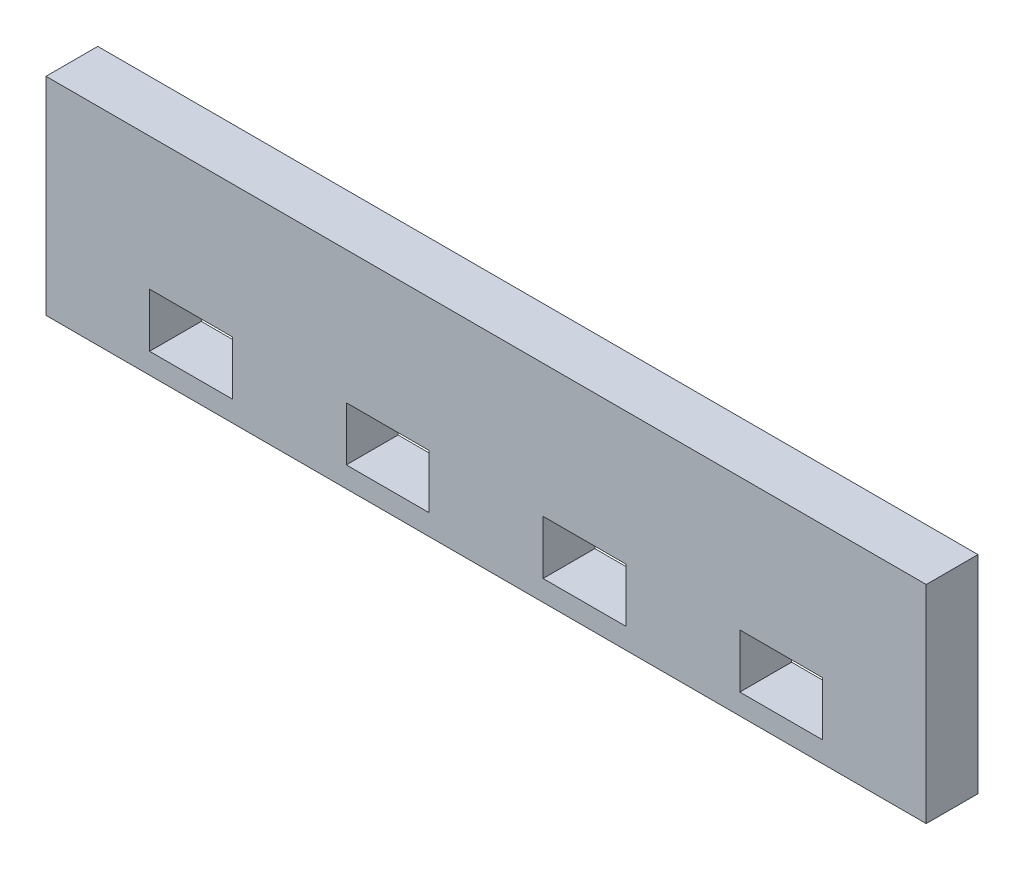
ISO-10303-21;
HEADER;
FILE_DESCRIPTION(('STEP AP214'),'2;1');
FILE_NAME('part.step','',(''),(''),'','','');
FILE_SCHEMA(('AUTOMOTIVE_DESIGN { 1 0 10303 214 1 1 1 1 }'));
ENDSEC;
DATA;
#1=APPLICATION_CONTEXT('core data for automotive mechanical design processes');
#2=APPLICATION_PROTOCOL_DEFINITION('international standard','automotive_design',2000,#1);
#3=PRODUCT_CONTEXT('',#1,'mechanical');
#4=PRODUCT('Part','Part','',(#3));
#5=PRODUCT_RELATED_PRODUCT_CATEGORY('part','',(#4));
#6=PRODUCT_DEFINITION_FORMATION('','',#4);
#7=PRODUCT_DEFINITION_CONTEXT('part definition',#1,'design');
#8=PRODUCT_DEFINITION('design','',#6,#7);
#9=PRODUCT_DEFINITION_SHAPE('','',#8);
#10=(LENGTH_UNIT() NAMED_UNIT(*) SI_UNIT(.MILLI.,.METRE.));
#11=(NAMED_UNIT(*) PLANE_ANGLE_UNIT() SI_UNIT($,.RADIAN.));
#12=(NAMED_UNIT(*) SI_UNIT($,.STERADIAN.) SOLID_ANGLE_UNIT());
#13=UNCERTAINTY_MEASURE_WITH_UNIT(LENGTH_MEASURE(1.E-05),#10,'distance_accuracy_value','');
#14=(GEOMETRIC_REPRESENTATION_CONTEXT(3) GLOBAL_UNCERTAINTY_ASSIGNED_CONTEXT((#13)) GLOBAL_UNIT_ASSIGNED_CONTEXT((#10,
#11,#12)) REPRESENTATION_CONTEXT('',''));
#15=CARTESIAN_POINT('',(0.,0.,0.));
#16=DIRECTION('',(0.,0.,1.));
#17=DIRECTION('',(1.,0.,0.));
#18=AXIS2_PLACEMENT_3D('',#15,#16,#17);
#19=CARTESIAN_POINT('',(-21.9712334180073,20.,5.));
#20=DIRECTION('',(1.,0.,0.));
#21=DIRECTION('',(0.,0.,-1.));
#22=AXIS2_PLACEMENT_3D('',#19,#20,#21);
#23=PLANE('',#22);
#24=DIRECTION('',(0.,-1.,0.));
#25=VECTOR('',#24,1.);
#26=CARTESIAN_POINT('',(-21.9712334180073,20.,0.));
#27=LINE('',#26,#25);
#28=CARTESIAN_POINT('',(-21.9712334180073,20.,0.));
#29=VERTEX_POINT('',#28);
#30=CARTESIAN_POINT('',(-21.9712334180073,0.,0.));
#31=VERTEX_POINT('',#30);
#32=EDGE_CURVE('E300',#29,#31,#27,.T.);
#33=ORIENTED_EDGE('',*,*,#32,.T.);
#34=DIRECTION('',(0.,0.,-1.));
#35=VECTOR('',#34,1.);
#36=CARTESIAN_POINT('',(-21.9712334180073,0.,5.));
#37=LINE('',#36,#35);
#38=CARTESIAN_POINT('',(-21.9712334180073,0.,5.));
#39=VERTEX_POINT('',#38);
#40=EDGE_CURVE('E11',#39,#31,#37,.T.);
#41=ORIENTED_EDGE('',*,*,#40,.F.);
#42=DIRECTION('',(0.,-1.,0.));
#43=VECTOR('',#42,1.);
#44=CARTESIAN_POINT('',(-21.9712334180073,20.,5.));
#45=LINE('',#44,#43);
#46=CARTESIAN_POINT('',(-21.9712334180073,20.,5.));
#47=VERTEX_POINT('',#46);
#48=EDGE_CURVE('E301',#47,#39,#45,.T.);
#49=ORIENTED_EDGE('',*,*,#48,.F.);
#50=DIRECTION('',(0.,0.,-1.));
#51=VECTOR('',#50,1.);
#52=CARTESIAN_POINT('',(-21.9712334180073,20.,5.));
#53=LINE('',#52,#51);
#54=EDGE_CURVE('E313',#47,#29,#53,.T.);
#55=ORIENTED_EDGE('',*,*,#54,.T.);
#56=EDGE_LOOP('',(#33,#41,#49,#55));
#57=FACE_BOUND('',#56,.T.);
#58=ADVANCED_FACE('F35',(#57),#23,.F.);
#59=CARTESIAN_POINT('',(-21.9712334180073,0.,5.));
#60=DIRECTION('',(0.,1.,0.));
#61=DIRECTION('',(0.,0.,1.));
#62=AXIS2_PLACEMENT_3D('',#59,#60,#61);
#63=PLANE('',#62);
#64=DIRECTION('',(1.,0.,0.));
#65=VECTOR('',#64,1.);
#66=CARTESIAN_POINT('',(-21.9712334180073,0.,0.));
#67=LINE('',#66,#65);
#68=CARTESIAN_POINT('',(63.0287665819927,0.,0.));
#69=VERTEX_POINT('',#68);
#70=EDGE_CURVE('E316',#31,#69,#67,.T.);
#71=ORIENTED_EDGE('',*,*,#70,.T.);
#72=DIRECTION('',(0.,0.,-1.));
#73=VECTOR('',#72,1.);
#74=CARTESIAN_POINT('',(63.0287665819927,0.,5.));
#75=LINE('',#74,#73);
#76=CARTESIAN_POINT('',(63.0287665819927,0.,5.));
#77=VERTEX_POINT('',#76);
#78=EDGE_CURVE('E42',#77,#69,#75,.T.);
#79=ORIENTED_EDGE('',*,*,#78,.F.);
#80=DIRECTION('',(1.,0.,0.));
#81=VECTOR('',#80,1.);
#82=CARTESIAN_POINT('',(-21.9712334180073,0.,5.));
#83=LINE('',#82,#81);
#84=EDGE_CURVE('E304',#39,#77,#83,.T.);
#85=ORIENTED_EDGE('',*,*,#84,.F.);
#86=ORIENTED_EDGE('',*,*,#40,.T.);
#87=EDGE_LOOP('',(#71,#79,#85,#86));
#88=FACE_BOUND('',#87,.T.);
#89=ADVANCED_FACE('F332',(#88),#63,.F.);
#90=CARTESIAN_POINT('',(63.0287665819927,20.,5.));
#91=DIRECTION('',(1.,0.,0.));
#92=DIRECTION('',(0.,0.,-1.));
#93=AXIS2_PLACEMENT_3D('',#90,#91,#92);
#94=PLANE('',#93);
#95=DIRECTION('',(0.,-1.,0.));
#96=VECTOR('',#95,1.);
#97=CARTESIAN_POINT('',(63.0287665819927,20.,0.));
#98=LINE('',#97,#96);
#99=CARTESIAN_POINT('',(63.0287665819927,20.,0.));
#100=VERTEX_POINT('',#99);
#101=EDGE_CURVE('E319',#100,#69,#98,.T.);
#102=ORIENTED_EDGE('',*,*,#101,.F.);
#103=DIRECTION('',(0.,0.,-1.));
#104=VECTOR('',#103,1.);
#105=CARTESIAN_POINT('',(63.0287665819927,20.,5.));
#106=LINE('',#105,#104);
#107=CARTESIAN_POINT('',(63.0287665819927,20.,5.));
#108=VERTEX_POINT('',#107);
#109=EDGE_CURVE('E325',#108,#100,#106,.T.);
#110=ORIENTED_EDGE('',*,*,#109,.F.);
#111=DIRECTION('',(0.,-1.,0.));
#112=VECTOR('',#111,1.);
#113=CARTESIAN_POINT('',(63.0287665819927,20.,5.));
#114=LINE('',#113,#112);
#115=EDGE_CURVE('E307',#108,#77,#114,.T.);
#116=ORIENTED_EDGE('',*,*,#115,.T.);
#117=ORIENTED_EDGE('',*,*,#78,.T.);
#118=EDGE_LOOP('',(#102,#110,#116,#117));
#119=FACE_BOUND('',#118,.T.);
#120=ADVANCED_FACE('F329',(#119),#94,.T.);
#121=CARTESIAN_POINT('',(-21.9712334180073,20.,5.));
#122=DIRECTION('',(0.,1.,0.));
#123=DIRECTION('',(0.,0.,1.));
#124=AXIS2_PLACEMENT_3D('',#121,#122,#123);
#125=PLANE('',#124);
#126=DIRECTION('',(1.,0.,0.));
#127=VECTOR('',#126,1.);
#128=CARTESIAN_POINT('',(-21.9712334180073,20.,0.));
#129=LINE('',#128,#127);
#130=EDGE_CURVE('E305',#29,#100,#129,.T.);
#131=ORIENTED_EDGE('',*,*,#130,.F.);
#132=ORIENTED_EDGE('',*,*,#54,.F.);
#133=DIRECTION('',(1.,0.,0.));
#134=VECTOR('',#133,1.);
#135=CARTESIAN_POINT('',(-21.9712334180073,20.,5.));
#136=LINE('',#135,#134);
#137=EDGE_CURVE('E310',#47,#108,#136,.T.);
#138=ORIENTED_EDGE('',*,*,#137,.T.);
#139=ORIENTED_EDGE('',*,*,#109,.T.);
#140=EDGE_LOOP('',(#131,#132,#138,#139));
#141=FACE_BOUND('',#140,.T.);
#142=ADVANCED_FACE('F338',(#141),#125,.T.);
#143=CARTESIAN_POINT('',(0.,0.,5.));
#144=DIRECTION('',(0.,0.,1.));
#145=DIRECTION('',(1.,0.,0.));
#146=AXIS2_PLACEMENT_3D('',#143,#144,#145);
#147=PLANE('',#146);
#148=DIRECTION('',(0.,-1.,0.));
#149=VECTOR('',#148,1.);
#150=CARTESIAN_POINT('',(45.0287665819927,7.2,5.));
#151=LINE('',#150,#149);
#152=CARTESIAN_POINT('',(45.0287665819927,7.2,5.));
#153=VERTEX_POINT('',#152);
#154=CARTESIAN_POINT('',(45.0287665819927,2.,5.));
#155=VERTEX_POINT('',#154);
#156=EDGE_CURVE('E49',#153,#155,#151,.T.);
#157=ORIENTED_EDGE('',*,*,#156,.F.);
#158=DIRECTION('',(-1.,0.,0.));
#159=VECTOR('',#158,1.);
#160=CARTESIAN_POINT('',(45.0287665819927,7.2,5.));
#161=LINE('',#160,#159);
#162=CARTESIAN_POINT('',(53.0287665819927,7.2,5.));
#163=VERTEX_POINT('',#162);
#164=EDGE_CURVE('E179',#163,#153,#161,.T.);
#165=ORIENTED_EDGE('',*,*,#164,.F.);
#166=DIRECTION('',(0.,1.,0.));
#167=VECTOR('',#166,1.);
#168=CARTESIAN_POINT('',(53.0287665819927,7.2,5.));
#169=LINE('',#168,#167);
#170=CARTESIAN_POINT('',(53.0287665819927,2.,5.));
#171=VERTEX_POINT('',#170);
#172=EDGE_CURVE('E199',#171,#163,#169,.T.);
#173=ORIENTED_EDGE('',*,*,#172,.F.);
#174=DIRECTION('',(1.,0.,0.));
#175=VECTOR('',#174,1.);
#176=CARTESIAN_POINT('',(45.0287665819927,2.,5.));
#177=LINE('',#176,#175);
#178=EDGE_CURVE('E193',#155,#171,#177,.T.);
#179=ORIENTED_EDGE('',*,*,#178,.F.);
#180=EDGE_LOOP('',(#157,#165,#173,#179));
#181=FACE_BOUND('',#180,.T.);
#182=DIRECTION('',(0.,-1.,0.));
#183=VECTOR('',#182,1.);
#184=CARTESIAN_POINT('',(26.0287665819927,7.2,5.));
#185=LINE('',#184,#183);
#186=CARTESIAN_POINT('',(26.0287665819927,7.2,5.));
#187=VERTEX_POINT('',#186);
#188=CARTESIAN_POINT('',(26.0287665819927,2.,5.));
#189=VERTEX_POINT('',#188);
#190=EDGE_CURVE('E215',#187,#189,#185,.T.);
#191=ORIENTED_EDGE('',*,*,#190,.F.);
#192=DIRECTION('',(-1.,0.,0.));
#193=VECTOR('',#192,1.);
#194=CARTESIAN_POINT('',(26.0287665819927,7.2,5.));
#195=LINE('',#194,#193);
#196=CARTESIAN_POINT('',(34.0287665819927,7.2,5.));
#197=VERTEX_POINT('',#196);
#198=EDGE_CURVE('E223',#197,#187,#195,.T.);
#199=ORIENTED_EDGE('',*,*,#198,.F.);
#200=DIRECTION('',(0.,1.,0.));
#201=VECTOR('',#200,1.);
#202=CARTESIAN_POINT('',(34.0287665819927,7.2,5.));
#203=LINE('',#202,#201);
#204=CARTESIAN_POINT('',(34.0287665819927,2.,5.));
#205=VERTEX_POINT('',#204);
#206=EDGE_CURVE('E220',#205,#197,#203,.T.);
#207=ORIENTED_EDGE('',*,*,#206,.F.);
#208=DIRECTION('',(1.,0.,0.));
#209=VECTOR('',#208,1.);
#210=CARTESIAN_POINT('',(26.0287665819927,2.,5.));
#211=LINE('',#210,#209);
#212=EDGE_CURVE('E217',#189,#205,#211,.T.);
#213=ORIENTED_EDGE('',*,*,#212,.F.);
#214=EDGE_LOOP('',(#191,#199,#207,#213));
#215=FACE_BOUND('',#214,.T.);
#216=DIRECTION('',(0.,-1.,0.));
#217=VECTOR('',#216,1.);
#218=CARTESIAN_POINT('',(7.02876658199267,7.2,5.));
#219=LINE('',#218,#217);
#220=CARTESIAN_POINT('',(7.02876658199267,7.2,5.));
#221=VERTEX_POINT('',#220);
#222=CARTESIAN_POINT('',(7.02876658199267,2.,5.));
#223=VERTEX_POINT('',#222);
#224=EDGE_CURVE('E246',#221,#223,#219,.T.);
#225=ORIENTED_EDGE('',*,*,#224,.F.);
#226=DIRECTION('',(-1.,0.,0.));
#227=VECTOR('',#226,1.);
#228=CARTESIAN_POINT('',(7.02876658199267,7.2,5.));
#229=LINE('',#228,#227);
#230=CARTESIAN_POINT('',(15.0287665819927,7.2,5.));
#231=VERTEX_POINT('',#230);
#232=EDGE_CURVE('E254',#231,#221,#229,.T.);
#233=ORIENTED_EDGE('',*,*,#232,.F.);
#234=DIRECTION('',(0.,1.,0.));
#235=VECTOR('',#234,1.);
#236=CARTESIAN_POINT('',(15.0287665819927,7.2,5.));
#237=LINE('',#236,#235);
#238=CARTESIAN_POINT('',(15.0287665819927,2.,5.));
#239=VERTEX_POINT('',#238);
#240=EDGE_CURVE('E251',#239,#231,#237,.T.);
#241=ORIENTED_EDGE('',*,*,#240,.F.);
#242=DIRECTION('',(1.,0.,0.));
#243=VECTOR('',#242,1.);
#244=CARTESIAN_POINT('',(7.02876658199267,2.,5.));
#245=LINE('',#244,#243);
#246=EDGE_CURVE('E248',#223,#239,#245,.T.);
#247=ORIENTED_EDGE('',*,*,#246,.F.);
#248=EDGE_LOOP('',(#225,#233,#241,#247));
#249=FACE_BOUND('',#248,.T.);
#250=DIRECTION('',(0.,-1.,0.));
#251=VECTOR('',#250,1.);
#252=CARTESIAN_POINT('',(-11.9712334180073,7.2,5.));
#253=LINE('',#252,#251);
#254=CARTESIAN_POINT('',(-11.9712334180073,7.2,5.));
#255=VERTEX_POINT('',#254);
#256=CARTESIAN_POINT('',(-11.9712334180073,2.,5.));
#257=VERTEX_POINT('',#256);
#258=EDGE_CURVE('E277',#255,#257,#253,.T.);
#259=ORIENTED_EDGE('',*,*,#258,.F.);
#260=DIRECTION('',(-1.,0.,0.));
#261=VECTOR('',#260,1.);
#262=CARTESIAN_POINT('',(-11.9712334180073,7.2,5.));
#263=LINE('',#262,#261);
#264=CARTESIAN_POINT('',(-3.97123341800733,7.2,5.));
#265=VERTEX_POINT('',#264);
#266=EDGE_CURVE('E285',#265,#255,#263,.T.);
#267=ORIENTED_EDGE('',*,*,#266,.F.);
#268=DIRECTION('',(0.,1.,0.));
#269=VECTOR('',#268,1.);
#270=CARTESIAN_POINT('',(-3.97123341800733,7.2,5.));
#271=LINE('',#270,#269);
#272=CARTESIAN_POINT('',(-3.97123341800733,2.,5.));
#273=VERTEX_POINT('',#272);
#274=EDGE_CURVE('E282',#273,#265,#271,.T.);
#275=ORIENTED_EDGE('',*,*,#274,.F.);
#276=DIRECTION('',(1.,0.,0.));
#277=VECTOR('',#276,1.);
#278=CARTESIAN_POINT('',(-11.9712334180073,2.,5.));
#279=LINE('',#278,#277);
#280=EDGE_CURVE('E279',#257,#273,#279,.T.);
#281=ORIENTED_EDGE('',*,*,#280,.F.);
#282=EDGE_LOOP('',(#259,#267,#275,#281));
#283=FACE_BOUND('',#282,.T.);
#284=ORIENTED_EDGE('',*,*,#48,.T.);
#285=ORIENTED_EDGE('',*,*,#84,.T.);
#286=ORIENTED_EDGE('',*,*,#115,.F.);
#287=ORIENTED_EDGE('',*,*,#137,.F.);
#288=EDGE_LOOP('',(#284,#285,#286,#287));
#289=FACE_BOUND('',#288,.T.);
#290=ADVANCED_FACE('F342',(#181,#215,#249,#283,#289),#147,.T.);
#291=CARTESIAN_POINT('',(0.,0.,0.));
#292=DIRECTION('',(0.,0.,1.));
#293=DIRECTION('',(1.,0.,0.));
#294=AXIS2_PLACEMENT_3D('',#291,#292,#293);
#295=PLANE('',#294);
#296=DIRECTION('',(1.,0.,0.));
#297=VECTOR('',#296,1.);
#298=CARTESIAN_POINT('',(45.0287665819927,7.2,0.));
#299=LINE('',#298,#297);
#300=CARTESIAN_POINT('',(45.0287665819927,7.2,0.));
#301=VERTEX_POINT('',#300);
#302=CARTESIAN_POINT('',(53.0287665819927,7.2,0.));
#303=VERTEX_POINT('',#302);
#304=EDGE_CURVE('E191',#301,#303,#299,.T.);
#305=ORIENTED_EDGE('',*,*,#304,.F.);
#306=DIRECTION('',(0.,1.,0.));
#307=VECTOR('',#306,1.);
#308=CARTESIAN_POINT('',(45.0287665819927,7.2,0.));
#309=LINE('',#308,#307);
#310=CARTESIAN_POINT('',(45.0287665819927,2.,0.));
#311=VERTEX_POINT('',#310);
#312=EDGE_CURVE('E173',#311,#301,#309,.T.);
#313=ORIENTED_EDGE('',*,*,#312,.F.);
#314=DIRECTION('',(-1.,0.,0.));
#315=VECTOR('',#314,1.);
#316=CARTESIAN_POINT('',(45.0287665819927,2.,0.));
#317=LINE('',#316,#315);
#318=CARTESIAN_POINT('',(53.0287665819927,2.,0.));
#319=VERTEX_POINT('',#318);
#320=EDGE_CURVE('E182',#319,#311,#317,.T.);
#321=ORIENTED_EDGE('',*,*,#320,.F.);
#322=DIRECTION('',(0.,-1.,0.));
#323=VECTOR('',#322,1.);
#324=CARTESIAN_POINT('',(53.0287665819927,7.2,0.));
#325=LINE('',#324,#323);
#326=EDGE_CURVE('E57',#303,#319,#325,.T.);
#327=ORIENTED_EDGE('',*,*,#326,.F.);
#328=EDGE_LOOP('',(#305,#313,#321,#327));
#329=FACE_BOUND('',#328,.T.);
#330=DIRECTION('',(1.,0.,0.));
#331=VECTOR('',#330,1.);
#332=CARTESIAN_POINT('',(26.0287665819927,7.2,0.));
#333=LINE('',#332,#331);
#334=CARTESIAN_POINT('',(26.0287665819927,7.2,0.));
#335=VERTEX_POINT('',#334);
#336=CARTESIAN_POINT('',(34.0287665819927,7.2,0.));
#337=VERTEX_POINT('',#336);
#338=EDGE_CURVE('E209',#335,#337,#333,.T.);
#339=ORIENTED_EDGE('',*,*,#338,.F.);
#340=DIRECTION('',(0.,1.,0.));
#341=VECTOR('',#340,1.);
#342=CARTESIAN_POINT('',(26.0287665819927,7.2,0.));
#343=LINE('',#342,#341);
#344=CARTESIAN_POINT('',(26.0287665819927,2.,0.));
#345=VERTEX_POINT('',#344);
#346=EDGE_CURVE('E212',#345,#335,#343,.T.);
#347=ORIENTED_EDGE('',*,*,#346,.F.);
#348=DIRECTION('',(-1.,0.,0.));
#349=VECTOR('',#348,1.);
#350=CARTESIAN_POINT('',(26.0287665819927,2.,0.));
#351=LINE('',#350,#349);
#352=CARTESIAN_POINT('',(34.0287665819927,2.,0.));
#353=VERTEX_POINT('',#352);
#354=EDGE_CURVE('E229',#353,#345,#351,.T.);
#355=ORIENTED_EDGE('',*,*,#354,.F.);
#356=DIRECTION('',(0.,-1.,0.));
#357=VECTOR('',#356,1.);
#358=CARTESIAN_POINT('',(34.0287665819927,7.2,0.));
#359=LINE('',#358,#357);
#360=EDGE_CURVE('E185',#337,#353,#359,.T.);
#361=ORIENTED_EDGE('',*,*,#360,.F.);
#362=EDGE_LOOP('',(#339,#347,#355,#361));
#363=FACE_BOUND('',#362,.T.);
#364=DIRECTION('',(1.,0.,0.));
#365=VECTOR('',#364,1.);
#366=CARTESIAN_POINT('',(7.02876658199267,7.2,0.));
#367=LINE('',#366,#365);
#368=CARTESIAN_POINT('',(7.02876658199267,7.2,0.));
#369=VERTEX_POINT('',#368);
#370=CARTESIAN_POINT('',(15.0287665819927,7.2,0.));
#371=VERTEX_POINT('',#370);
#372=EDGE_CURVE('E240',#369,#371,#367,.T.);
#373=ORIENTED_EDGE('',*,*,#372,.F.);
#374=DIRECTION('',(0.,1.,0.));
#375=VECTOR('',#374,1.);
#376=CARTESIAN_POINT('',(7.02876658199267,7.2,0.));
#377=LINE('',#376,#375);
#378=CARTESIAN_POINT('',(7.02876658199267,2.,0.));
#379=VERTEX_POINT('',#378);
#380=EDGE_CURVE('E243',#379,#369,#377,.T.);
#381=ORIENTED_EDGE('',*,*,#380,.F.);
#382=DIRECTION('',(-1.,0.,0.));
#383=VECTOR('',#382,1.);
#384=CARTESIAN_POINT('',(7.02876658199267,2.,0.));
#385=LINE('',#384,#383);
#386=CARTESIAN_POINT('',(15.0287665819927,2.,0.));
#387=VERTEX_POINT('',#386);
#388=EDGE_CURVE('E260',#387,#379,#385,.T.);
#389=ORIENTED_EDGE('',*,*,#388,.F.);
#390=DIRECTION('',(0.,-1.,0.));
#391=VECTOR('',#390,1.);
#392=CARTESIAN_POINT('',(15.0287665819927,7.2,0.));
#393=LINE('',#392,#391);
#394=EDGE_CURVE('E238',#371,#387,#393,.T.);
#395=ORIENTED_EDGE('',*,*,#394,.F.);
#396=EDGE_LOOP('',(#373,#381,#389,#395));
#397=FACE_BOUND('',#396,.T.);
#398=DIRECTION('',(1.,0.,0.));
#399=VECTOR('',#398,1.);
#400=CARTESIAN_POINT('',(-11.9712334180073,7.2,0.));
#401=LINE('',#400,#399);
#402=CARTESIAN_POINT('',(-11.9712334180073,7.2,0.));
#403=VERTEX_POINT('',#402);
#404=CARTESIAN_POINT('',(-3.97123341800733,7.2,0.));
#405=VERTEX_POINT('',#404);
#406=EDGE_CURVE('E271',#403,#405,#401,.T.);
#407=ORIENTED_EDGE('',*,*,#406,.F.);
#408=DIRECTION('',(0.,1.,0.));
#409=VECTOR('',#408,1.);
#410=CARTESIAN_POINT('',(-11.9712334180073,7.2,0.));
#411=LINE('',#410,#409);
#412=CARTESIAN_POINT('',(-11.9712334180073,2.,0.));
#413=VERTEX_POINT('',#412);
#414=EDGE_CURVE('E274',#413,#403,#411,.T.);
#415=ORIENTED_EDGE('',*,*,#414,.F.);
#416=DIRECTION('',(-1.,0.,0.));
#417=VECTOR('',#416,1.);
#418=CARTESIAN_POINT('',(-11.9712334180073,2.,0.));
#419=LINE('',#418,#417);
#420=CARTESIAN_POINT('',(-3.97123341800733,2.,0.));
#421=VERTEX_POINT('',#420);
#422=EDGE_CURVE('E291',#421,#413,#419,.T.);
#423=ORIENTED_EDGE('',*,*,#422,.F.);
#424=DIRECTION('',(0.,-1.,0.));
#425=VECTOR('',#424,1.);
#426=CARTESIAN_POINT('',(-3.97123341800733,7.2,0.));
#427=LINE('',#426,#425);
#428=EDGE_CURVE('E269',#405,#421,#427,.T.);
#429=ORIENTED_EDGE('',*,*,#428,.F.);
#430=EDGE_LOOP('',(#407,#415,#423,#429));
#431=FACE_BOUND('',#430,.T.);
#432=ORIENTED_EDGE('',*,*,#32,.F.);
#433=ORIENTED_EDGE('',*,*,#130,.T.);
#434=ORIENTED_EDGE('',*,*,#101,.T.);
#435=ORIENTED_EDGE('',*,*,#70,.F.);
#436=EDGE_LOOP('',(#432,#433,#434,#435));
#437=FACE_BOUND('',#436,.T.);
#438=ADVANCED_FACE('F188',(#329,#363,#397,#431,#437),#295,.F.);
#439=CARTESIAN_POINT('',(-11.9712334180073,7.2,-0.00100000000000013));
#440=DIRECTION('',(-1.,0.,0.));
#441=DIRECTION('',(0.,0.,1.));
#442=AXIS2_PLACEMENT_3D('',#439,#440,#441);
#443=PLANE('',#442);
#444=ORIENTED_EDGE('',*,*,#414,.T.);
#445=DIRECTION('',(0.,0.,1.));
#446=VECTOR('',#445,1.);
#447=CARTESIAN_POINT('',(-11.9712334180073,7.2,-0.00100000000000013));
#448=LINE('',#447,#446);
#449=EDGE_CURVE('E289',#403,#255,#448,.T.);
#450=ORIENTED_EDGE('',*,*,#449,.T.);
#451=ORIENTED_EDGE('',*,*,#258,.T.);
#452=DIRECTION('',(0.,0.,1.));
#453=VECTOR('',#452,1.);
#454=CARTESIAN_POINT('',(-11.9712334180073,2.,-0.00100000000000013));
#455=LINE('',#454,#453);
#456=EDGE_CURVE('E288',#413,#257,#455,.T.);
#457=ORIENTED_EDGE('',*,*,#456,.F.);
#458=EDGE_LOOP('',(#444,#450,#451,#457));
#459=FACE_BOUND('',#458,.T.);
#460=ADVANCED_FACE('F357',(#459),#443,.F.);
#461=CARTESIAN_POINT('',(-11.9712334180073,7.2,-0.00100000000000013));
#462=DIRECTION('',(0.,1.,0.));
#463=DIRECTION('',(0.,0.,1.));
#464=AXIS2_PLACEMENT_3D('',#461,#462,#463);
#465=PLANE('',#464);
#466=ORIENTED_EDGE('',*,*,#406,.T.);
#467=DIRECTION('',(0.,0.,1.));
#468=VECTOR('',#467,1.);
#469=CARTESIAN_POINT('',(-3.97123341800733,7.2,-0.00100000000000013));
#470=LINE('',#469,#468);
#471=EDGE_CURVE('E292',#405,#265,#470,.T.);
#472=ORIENTED_EDGE('',*,*,#471,.T.);
#473=ORIENTED_EDGE('',*,*,#266,.T.);
#474=ORIENTED_EDGE('',*,*,#449,.F.);
#475=EDGE_LOOP('',(#466,#472,#473,#474));
#476=FACE_BOUND('',#475,.T.);
#477=ADVANCED_FACE('F363',(#476),#465,.F.);
#478=CARTESIAN_POINT('',(-3.97123341800733,7.2,-0.00100000000000013));
#479=DIRECTION('',(1.,0.,0.));
#480=DIRECTION('',(0.,1.,0.));
#481=AXIS2_PLACEMENT_3D('',#478,#479,#480);
#482=PLANE('',#481);
#483=ORIENTED_EDGE('',*,*,#428,.T.);
#484=DIRECTION('',(0.,0.,1.));
#485=VECTOR('',#484,1.);
#486=CARTESIAN_POINT('',(-3.97123341800733,2.,-0.00100000000000013));
#487=LINE('',#486,#485);
#488=EDGE_CURVE('E294',#421,#273,#487,.T.);
#489=ORIENTED_EDGE('',*,*,#488,.T.);
#490=ORIENTED_EDGE('',*,*,#274,.T.);
#491=ORIENTED_EDGE('',*,*,#471,.F.);
#492=EDGE_LOOP('',(#483,#489,#490,#491));
#493=FACE_BOUND('',#492,.T.);
#494=ADVANCED_FACE('F369',(#493),#482,.F.);
#495=CARTESIAN_POINT('',(-11.9712334180073,2.,-0.00100000000000013));
#496=DIRECTION('',(0.,-1.,0.));
#497=DIRECTION('',(1.,0.,0.));
#498=AXIS2_PLACEMENT_3D('',#495,#496,#497);
#499=PLANE('',#498);
#500=ORIENTED_EDGE('',*,*,#422,.T.);
#501=ORIENTED_EDGE('',*,*,#456,.T.);
#502=ORIENTED_EDGE('',*,*,#280,.T.);
#503=ORIENTED_EDGE('',*,*,#488,.F.);
#504=EDGE_LOOP('',(#500,#501,#502,#503));
#505=FACE_BOUND('',#504,.T.);
#506=ADVANCED_FACE('F365',(#505),#499,.F.);
#507=CARTESIAN_POINT('',(7.02876658199267,7.2,-0.00100000000000013));
#508=DIRECTION('',(-1.,0.,0.));
#509=DIRECTION('',(0.,0.,1.));
#510=AXIS2_PLACEMENT_3D('',#507,#508,#509);
#511=PLANE('',#510);
#512=ORIENTED_EDGE('',*,*,#380,.T.);
#513=DIRECTION('',(0.,0.,1.));
#514=VECTOR('',#513,1.);
#515=CARTESIAN_POINT('',(7.02876658199267,7.2,-0.00100000000000013));
#516=LINE('',#515,#514);
#517=EDGE_CURVE('E258',#369,#221,#516,.T.);
#518=ORIENTED_EDGE('',*,*,#517,.T.);
#519=ORIENTED_EDGE('',*,*,#224,.T.);
#520=DIRECTION('',(0.,0.,1.));
#521=VECTOR('',#520,1.);
#522=CARTESIAN_POINT('',(7.02876658199267,2.,-0.00100000000000013));
#523=LINE('',#522,#521);
#524=EDGE_CURVE('E257',#379,#223,#523,.T.);
#525=ORIENTED_EDGE('',*,*,#524,.F.);
#526=EDGE_LOOP('',(#512,#518,#519,#525));
#527=FACE_BOUND('',#526,.T.);
#528=ADVANCED_FACE('F368',(#527),#511,.F.);
#529=CARTESIAN_POINT('',(7.02876658199267,7.2,-0.00100000000000013));
#530=DIRECTION('',(0.,1.,0.));
#531=DIRECTION('',(0.,0.,1.));
#532=AXIS2_PLACEMENT_3D('',#529,#530,#531);
#533=PLANE('',#532);
#534=ORIENTED_EDGE('',*,*,#372,.T.);
#535=DIRECTION('',(0.,0.,1.));
#536=VECTOR('',#535,1.);
#537=CARTESIAN_POINT('',(15.0287665819927,7.2,-0.00100000000000013));
#538=LINE('',#537,#536);
#539=EDGE_CURVE('E261',#371,#231,#538,.T.);
#540=ORIENTED_EDGE('',*,*,#539,.T.);
#541=ORIENTED_EDGE('',*,*,#232,.T.);
#542=ORIENTED_EDGE('',*,*,#517,.F.);
#543=EDGE_LOOP('',(#534,#540,#541,#542));
#544=FACE_BOUND('',#543,.T.);
#545=ADVANCED_FACE('F379',(#544),#533,.F.);
#546=CARTESIAN_POINT('',(15.0287665819927,7.2,-0.00100000000000013));
#547=DIRECTION('',(1.,0.,0.));
#548=DIRECTION('',(0.,0.,-1.));
#549=AXIS2_PLACEMENT_3D('',#546,#547,#548);
#550=PLANE('',#549);
#551=ORIENTED_EDGE('',*,*,#394,.T.);
#552=DIRECTION('',(0.,0.,1.));
#553=VECTOR('',#552,1.);
#554=CARTESIAN_POINT('',(15.0287665819927,2.,-0.00100000000000013));
#555=LINE('',#554,#553);
#556=EDGE_CURVE('E263',#387,#239,#555,.T.);
#557=ORIENTED_EDGE('',*,*,#556,.T.);
#558=ORIENTED_EDGE('',*,*,#240,.T.);
#559=ORIENTED_EDGE('',*,*,#539,.F.);
#560=EDGE_LOOP('',(#551,#557,#558,#559));
#561=FACE_BOUND('',#560,.T.);
#562=ADVANCED_FACE('F385',(#561),#550,.F.);
#563=CARTESIAN_POINT('',(7.02876658199267,2.,-0.00100000000000013));
#564=DIRECTION('',(0.,-1.,0.));
#565=DIRECTION('',(1.,0.,0.));
#566=AXIS2_PLACEMENT_3D('',#563,#564,#565);
#567=PLANE('',#566);
#568=ORIENTED_EDGE('',*,*,#388,.T.);
#569=ORIENTED_EDGE('',*,*,#524,.T.);
#570=ORIENTED_EDGE('',*,*,#246,.T.);
#571=ORIENTED_EDGE('',*,*,#556,.F.);
#572=EDGE_LOOP('',(#568,#569,#570,#571));
#573=FACE_BOUND('',#572,.T.);
#574=ADVANCED_FACE('F381',(#573),#567,.F.);
#575=CARTESIAN_POINT('',(26.0287665819927,7.2,-0.00100000000000013));
#576=DIRECTION('',(-1.,0.,0.));
#577=DIRECTION('',(0.,0.,1.));
#578=AXIS2_PLACEMENT_3D('',#575,#576,#577);
#579=PLANE('',#578);
#580=ORIENTED_EDGE('',*,*,#346,.T.);
#581=DIRECTION('',(0.,0.,1.));
#582=VECTOR('',#581,1.);
#583=CARTESIAN_POINT('',(26.0287665819927,7.2,-0.00100000000000013));
#584=LINE('',#583,#582);
#585=EDGE_CURVE('E227',#335,#187,#584,.T.);
#586=ORIENTED_EDGE('',*,*,#585,.T.);
#587=ORIENTED_EDGE('',*,*,#190,.T.);
#588=DIRECTION('',(0.,0.,1.));
#589=VECTOR('',#588,1.);
#590=CARTESIAN_POINT('',(26.0287665819927,2.,-0.00100000000000013));
#591=LINE('',#590,#589);
#592=EDGE_CURVE('E226',#345,#189,#591,.T.);
#593=ORIENTED_EDGE('',*,*,#592,.F.);
#594=EDGE_LOOP('',(#580,#586,#587,#593));
#595=FACE_BOUND('',#594,.T.);
#596=ADVANCED_FACE('F384',(#595),#579,.F.);
#597=CARTESIAN_POINT('',(26.0287665819927,7.2,-0.00100000000000013));
#598=DIRECTION('',(0.,1.,0.));
#599=DIRECTION('',(0.,0.,1.));
#600=AXIS2_PLACEMENT_3D('',#597,#598,#599);
#601=PLANE('',#600);
#602=ORIENTED_EDGE('',*,*,#338,.T.);
#603=DIRECTION('',(0.,0.,1.));
#604=VECTOR('',#603,1.);
#605=CARTESIAN_POINT('',(34.0287665819927,7.2,-0.00100000000000013));
#606=LINE('',#605,#604);
#607=EDGE_CURVE('E230',#337,#197,#606,.T.);
#608=ORIENTED_EDGE('',*,*,#607,.T.);
#609=ORIENTED_EDGE('',*,*,#198,.T.);
#610=ORIENTED_EDGE('',*,*,#585,.F.);
#611=EDGE_LOOP('',(#602,#608,#609,#610));
#612=FACE_BOUND('',#611,.T.);
#613=ADVANCED_FACE('F395',(#612),#601,.F.);
#614=CARTESIAN_POINT('',(34.0287665819927,7.2,-0.00100000000000013));
#615=DIRECTION('',(1.,0.,0.));
#616=DIRECTION('',(0.,0.,-1.));
#617=AXIS2_PLACEMENT_3D('',#614,#615,#616);
#618=PLANE('',#617);
#619=ORIENTED_EDGE('',*,*,#360,.T.);
#620=DIRECTION('',(0.,0.,1.));
#621=VECTOR('',#620,1.);
#622=CARTESIAN_POINT('',(34.0287665819927,2.,-0.00100000000000013));
#623=LINE('',#622,#621);
#624=EDGE_CURVE('E232',#353,#205,#623,.T.);
#625=ORIENTED_EDGE('',*,*,#624,.T.);
#626=ORIENTED_EDGE('',*,*,#206,.T.);
#627=ORIENTED_EDGE('',*,*,#607,.F.);
#628=EDGE_LOOP('',(#619,#625,#626,#627));
#629=FACE_BOUND('',#628,.T.);
#630=ADVANCED_FACE('F400',(#629),#618,.F.);
#631=CARTESIAN_POINT('',(26.0287665819927,2.,-0.00100000000000013));
#632=DIRECTION('',(0.,-1.,0.));
#633=DIRECTION('',(1.,0.,0.));
#634=AXIS2_PLACEMENT_3D('',#631,#632,#633);
#635=PLANE('',#634);
#636=ORIENTED_EDGE('',*,*,#354,.T.);
#637=ORIENTED_EDGE('',*,*,#592,.T.);
#638=ORIENTED_EDGE('',*,*,#212,.T.);
#639=ORIENTED_EDGE('',*,*,#624,.F.);
#640=EDGE_LOOP('',(#636,#637,#638,#639));
#641=FACE_BOUND('',#640,.T.);
#642=ADVANCED_FACE('F397',(#641),#635,.F.);
#643=CARTESIAN_POINT('',(45.0287665819927,7.2,-0.00100000000000013));
#644=DIRECTION('',(-1.,0.,0.));
#645=DIRECTION('',(0.,0.,1.));
#646=AXIS2_PLACEMENT_3D('',#643,#644,#645);
#647=PLANE('',#646);
#648=ORIENTED_EDGE('',*,*,#312,.T.);
#649=DIRECTION('',(0.,0.,1.));
#650=VECTOR('',#649,1.);
#651=CARTESIAN_POINT('',(45.0287665819927,7.2,-0.00100000000000013));
#652=LINE('',#651,#650);
#653=EDGE_CURVE('E186',#301,#153,#652,.T.);
#654=ORIENTED_EDGE('',*,*,#653,.T.);
#655=ORIENTED_EDGE('',*,*,#156,.T.);
#656=DIRECTION('',(0.,0.,1.));
#657=VECTOR('',#656,1.);
#658=CARTESIAN_POINT('',(45.0287665819927,2.,-0.00100000000000013));
#659=LINE('',#658,#657);
#660=EDGE_CURVE('E169',#311,#155,#659,.T.);
#661=ORIENTED_EDGE('',*,*,#660,.F.);
#662=EDGE_LOOP('',(#648,#654,#655,#661));
#663=FACE_BOUND('',#662,.T.);
#664=ADVANCED_FACE('F171',(#663),#647,.F.);
#665=CARTESIAN_POINT('',(45.0287665819927,7.2,-0.00100000000000013));
#666=DIRECTION('',(0.,1.,0.));
#667=DIRECTION('',(0.,0.,1.));
#668=AXIS2_PLACEMENT_3D('',#665,#666,#667);
#669=PLANE('',#668);
#670=ORIENTED_EDGE('',*,*,#304,.T.);
#671=DIRECTION('',(0.,0.,1.));
#672=VECTOR('',#671,1.);
#673=CARTESIAN_POINT('',(53.0287665819927,7.2,-0.00100000000000013));
#674=LINE('',#673,#672);
#675=EDGE_CURVE('E205',#303,#163,#674,.T.);
#676=ORIENTED_EDGE('',*,*,#675,.T.);
#677=ORIENTED_EDGE('',*,*,#164,.T.);
#678=ORIENTED_EDGE('',*,*,#653,.F.);
#679=EDGE_LOOP('',(#670,#676,#677,#678));
#680=FACE_BOUND('',#679,.T.);
#681=ADVANCED_FACE('F410',(#680),#669,.F.);
#682=CARTESIAN_POINT('',(53.0287665819927,7.2,-0.00100000000000013));
#683=DIRECTION('',(1.,0.,0.));
#684=DIRECTION('',(0.,0.,-1.));
#685=AXIS2_PLACEMENT_3D('',#682,#683,#684);
#686=PLANE('',#685);
#687=ORIENTED_EDGE('',*,*,#326,.T.);
#688=DIRECTION('',(0.,0.,1.));
#689=VECTOR('',#688,1.);
#690=CARTESIAN_POINT('',(53.0287665819927,2.,-0.00100000000000013));
#691=LINE('',#690,#689);
#692=EDGE_CURVE('E178',#319,#171,#691,.T.);
#693=ORIENTED_EDGE('',*,*,#692,.T.);
#694=ORIENTED_EDGE('',*,*,#172,.T.);
#695=ORIENTED_EDGE('',*,*,#675,.F.);
#696=EDGE_LOOP('',(#687,#693,#694,#695));
#697=FACE_BOUND('',#696,.T.);
#698=ADVANCED_FACE('F413',(#697),#686,.F.);
#699=CARTESIAN_POINT('',(45.0287665819927,2.,-0.00100000000000013));
#700=DIRECTION('',(0.,-1.,0.));
#701=DIRECTION('',(1.,0.,0.));
#702=AXIS2_PLACEMENT_3D('',#699,#700,#701);
#703=PLANE('',#702);
#704=ORIENTED_EDGE('',*,*,#320,.T.);
#705=ORIENTED_EDGE('',*,*,#660,.T.);
#706=ORIENTED_EDGE('',*,*,#178,.T.);
#707=ORIENTED_EDGE('',*,*,#692,.F.);
#708=EDGE_LOOP('',(#704,#705,#706,#707));
#709=FACE_BOUND('',#708,.T.);
#710=ADVANCED_FACE('F183',(#709),#703,.F.);
#711=CLOSED_SHELL('',(#58,#89,#120,#142,#290,#438,#460,#477,#494,#506,#528,#545,#562,#574,#596,
#613,#630,#642,#664,#681,#698,#710));
#712=MANIFOLD_SOLID_BREP('B2',#711);
#713=ADVANCED_BREP_SHAPE_REPRESENTATION('',(#18,#712),#14);
#714=SHAPE_DEFINITION_REPRESENTATION(#9,#713);
ENDSEC;
END-ISO-10303-21;
